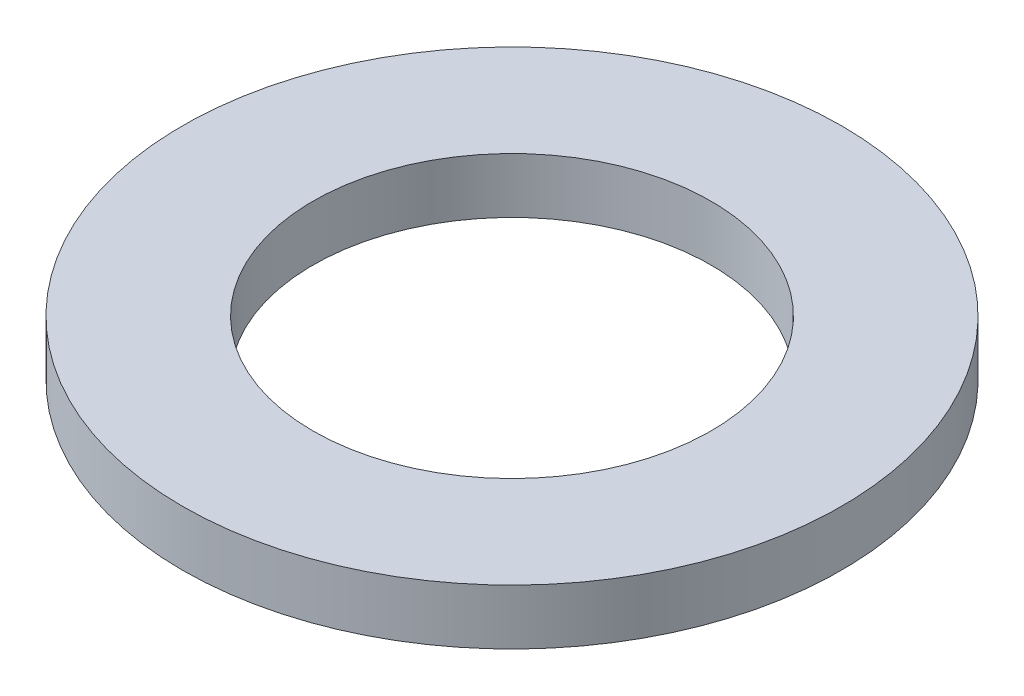
ISO-10303-21;
HEADER;
FILE_DESCRIPTION(('STEP AP214'),'2;1');
FILE_NAME('part.step','',(''),(''),'','','');
FILE_SCHEMA(('AUTOMOTIVE_DESIGN { 1 0 10303 214 1 1 1 1 }'));
ENDSEC;
DATA;
#1=APPLICATION_CONTEXT('core data for automotive mechanical design processes');
#2=APPLICATION_PROTOCOL_DEFINITION('international standard','automotive_design',2000,#1);
#3=PRODUCT_CONTEXT('',#1,'mechanical');
#4=PRODUCT('Part','Part','',(#3));
#5=PRODUCT_RELATED_PRODUCT_CATEGORY('part','',(#4));
#6=PRODUCT_DEFINITION_FORMATION('','',#4);
#7=PRODUCT_DEFINITION_CONTEXT('part definition',#1,'design');
#8=PRODUCT_DEFINITION('design','',#6,#7);
#9=PRODUCT_DEFINITION_SHAPE('','',#8);
#10=(LENGTH_UNIT() NAMED_UNIT(*) SI_UNIT(.MILLI.,.METRE.));
#11=(NAMED_UNIT(*) PLANE_ANGLE_UNIT() SI_UNIT($,.RADIAN.));
#12=(NAMED_UNIT(*) SI_UNIT($,.STERADIAN.) SOLID_ANGLE_UNIT());
#13=UNCERTAINTY_MEASURE_WITH_UNIT(LENGTH_MEASURE(1.E-05),#10,'distance_accuracy_value','');
#14=(GEOMETRIC_REPRESENTATION_CONTEXT(3) GLOBAL_UNCERTAINTY_ASSIGNED_CONTEXT((#13)) GLOBAL_UNIT_ASSIGNED_CONTEXT((#10,
#11,#12)) REPRESENTATION_CONTEXT('',''));
#15=CARTESIAN_POINT('',(0.,0.,0.));
#16=DIRECTION('',(0.,0.,1.));
#17=DIRECTION('',(1.,0.,0.));
#18=AXIS2_PLACEMENT_3D('',#15,#16,#17);
#19=CARTESIAN_POINT('',(0.,1.6002,0.));
#20=DIRECTION('',(0.,1.,0.));
#21=DIRECTION('',(0.,0.,1.));
#22=AXIS2_PLACEMENT_3D('',#19,#20,#21);
#23=PLANE('',#22);
#24=CARTESIAN_POINT('',(0.,1.6002,0.));
#25=DIRECTION('',(0.,1.,0.));
#26=DIRECTION('',(0.,0.,1.));
#27=AXIS2_PLACEMENT_3D('',#24,#25,#26);
#28=CIRCLE('',#27,9.525);
#29=CARTESIAN_POINT('',(0.,1.6002,9.525));
#30=VERTEX_POINT('',#29);
#31=EDGE_CURVE('E10',#30,#30,#28,.T.);
#32=ORIENTED_EDGE('',*,*,#31,.T.);
#33=EDGE_LOOP('',(#32));
#34=FACE_BOUND('',#33,.T.);
#35=CARTESIAN_POINT('',(0.,1.6002,0.));
#36=DIRECTION('',(0.,1.,0.));
#37=DIRECTION('',(0.,0.,1.));
#38=AXIS2_PLACEMENT_3D('',#35,#36,#37);
#39=CIRCLE('',#38,5.7531);
#40=CARTESIAN_POINT('',(0.,1.6002,5.7531));
#41=VERTEX_POINT('',#40);
#42=EDGE_CURVE('E41',#41,#41,#39,.T.);
#43=ORIENTED_EDGE('',*,*,#42,.F.);
#44=EDGE_LOOP('',(#43));
#45=FACE_BOUND('',#44,.T.);
#46=ADVANCED_FACE('F30',(#34,#45),#23,.T.);
#47=CARTESIAN_POINT('',(0.,0.,0.));
#48=DIRECTION('',(0.,1.,0.));
#49=DIRECTION('',(0.,0.,1.));
#50=AXIS2_PLACEMENT_3D('',#47,#48,#49);
#51=PLANE('',#50);
#52=CARTESIAN_POINT('',(0.,0.,0.));
#53=DIRECTION('',(0.,1.,0.));
#54=DIRECTION('',(0.,0.,1.));
#55=AXIS2_PLACEMENT_3D('',#52,#53,#54);
#56=CIRCLE('',#55,9.525);
#57=CARTESIAN_POINT('',(0.,0.,9.525));
#58=VERTEX_POINT('',#57);
#59=EDGE_CURVE('E34',#58,#58,#56,.T.);
#60=ORIENTED_EDGE('',*,*,#59,.F.);
#61=EDGE_LOOP('',(#60));
#62=FACE_BOUND('',#61,.T.);
#63=CARTESIAN_POINT('',(0.,0.,0.));
#64=DIRECTION('',(0.,1.,0.));
#65=DIRECTION('',(0.,0.,1.));
#66=AXIS2_PLACEMENT_3D('',#63,#64,#65);
#67=CIRCLE('',#66,5.7531);
#68=CARTESIAN_POINT('',(0.,0.,5.7531));
#69=VERTEX_POINT('',#68);
#70=EDGE_CURVE('E43',#69,#69,#67,.T.);
#71=ORIENTED_EDGE('',*,*,#70,.T.);
#72=EDGE_LOOP('',(#71));
#73=FACE_BOUND('',#72,.T.);
#74=ADVANCED_FACE('F53',(#62,#73),#51,.F.);
#75=CARTESIAN_POINT('',(0.,1.6002,0.));
#76=DIRECTION('',(0.,-1.,0.));
#77=DIRECTION('',(0.,0.,-1.));
#78=AXIS2_PLACEMENT_3D('',#75,#76,#77);
#79=CYLINDRICAL_SURFACE('',#78,9.525);
#80=ORIENTED_EDGE('',*,*,#31,.F.);
#81=EDGE_LOOP('',(#80));
#82=FACE_BOUND('',#81,.T.);
#83=ORIENTED_EDGE('',*,*,#59,.T.);
#84=EDGE_LOOP('',(#83));
#85=FACE_BOUND('',#84,.T.);
#86=ADVANCED_FACE('F32',(#82,#85),#79,.T.);
#87=CARTESIAN_POINT('',(0.,1.6002,0.));
#88=DIRECTION('',(0.,-1.,0.));
#89=DIRECTION('',(0.,0.,-1.));
#90=AXIS2_PLACEMENT_3D('',#87,#88,#89);
#91=CYLINDRICAL_SURFACE('',#90,5.7531);
#92=ORIENTED_EDGE('',*,*,#42,.T.);
#93=EDGE_LOOP('',(#92));
#94=FACE_BOUND('',#93,.T.);
#95=ORIENTED_EDGE('',*,*,#70,.F.);
#96=EDGE_LOOP('',(#95));
#97=FACE_BOUND('',#96,.T.);
#98=ADVANCED_FACE('F49',(#94,#97),#91,.F.);
#99=CLOSED_SHELL('',(#46,#74,#86,#98));
#100=MANIFOLD_SOLID_BREP('B2',#99);
#101=ADVANCED_BREP_SHAPE_REPRESENTATION('',(#18,#100),#14);
#102=SHAPE_DEFINITION_REPRESENTATION(#9,#101);
ENDSEC;
END-ISO-10303-21;
